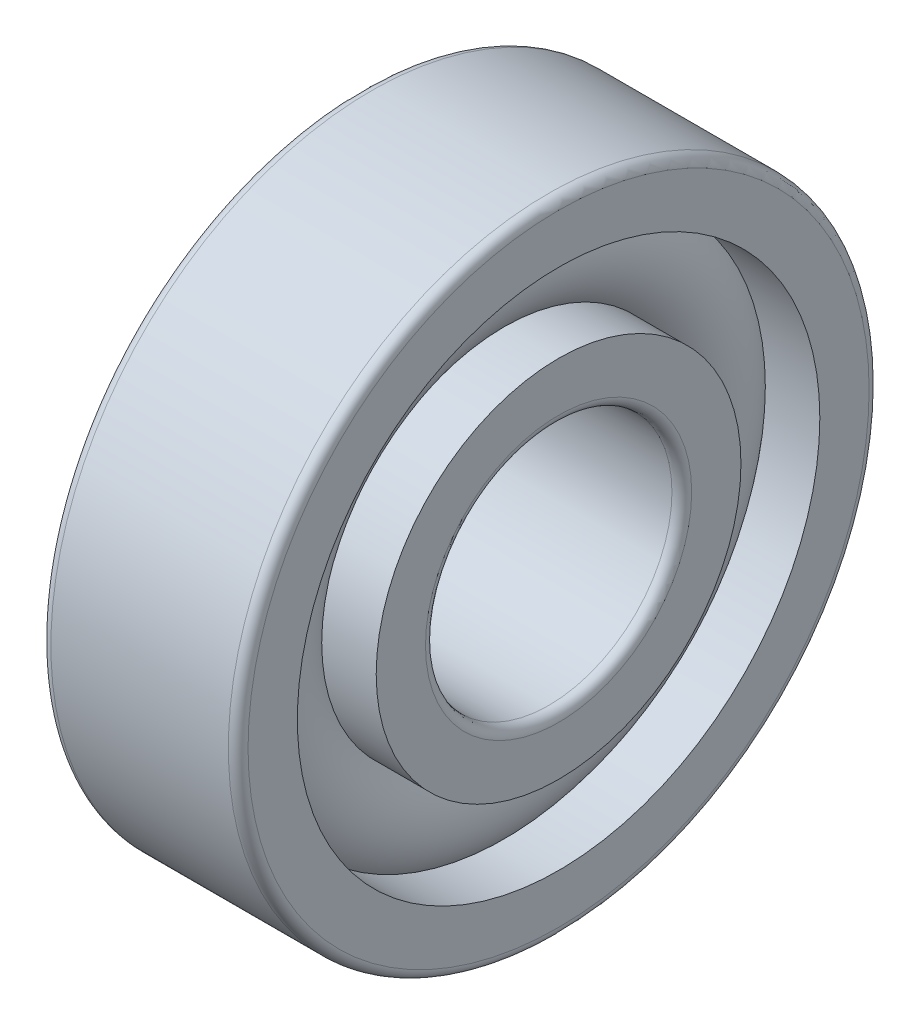
ISO-10303-21;
HEADER;
FILE_DESCRIPTION(('STEP AP214'),'2;1');
FILE_NAME('part.step','',(''),(''),'','','');
FILE_SCHEMA(('AUTOMOTIVE_DESIGN { 1 0 10303 214 1 1 1 1 }'));
ENDSEC;
DATA;
#1=APPLICATION_CONTEXT('core data for automotive mechanical design processes');
#2=APPLICATION_PROTOCOL_DEFINITION('international standard','automotive_design',2000,#1);
#3=PRODUCT_CONTEXT('',#1,'mechanical');
#4=PRODUCT('Part','Part','',(#3));
#5=PRODUCT_RELATED_PRODUCT_CATEGORY('part','',(#4));
#6=PRODUCT_DEFINITION_FORMATION('','',#4);
#7=PRODUCT_DEFINITION_CONTEXT('part definition',#1,'design');
#8=PRODUCT_DEFINITION('design','',#6,#7);
#9=PRODUCT_DEFINITION_SHAPE('','',#8);
#10=(LENGTH_UNIT() NAMED_UNIT(*) SI_UNIT(.MILLI.,.METRE.));
#11=(NAMED_UNIT(*) PLANE_ANGLE_UNIT() SI_UNIT($,.RADIAN.));
#12=(NAMED_UNIT(*) SI_UNIT($,.STERADIAN.) SOLID_ANGLE_UNIT());
#13=UNCERTAINTY_MEASURE_WITH_UNIT(LENGTH_MEASURE(1.E-05),#10,'distance_accuracy_value','');
#14=(GEOMETRIC_REPRESENTATION_CONTEXT(3) GLOBAL_UNCERTAINTY_ASSIGNED_CONTEXT((#13)) GLOBAL_UNIT_ASSIGNED_CONTEXT((#10,
#11,#12)) REPRESENTATION_CONTEXT('',''));
#15=CARTESIAN_POINT('',(0.,0.,0.));
#16=DIRECTION('',(0.,0.,1.));
#17=DIRECTION('',(1.,0.,0.));
#18=AXIS2_PLACEMENT_3D('',#15,#16,#17);
#19=CARTESIAN_POINT('',(0.,0.,0.));
#20=DIRECTION('',(-1.,0.,0.));
#21=DIRECTION('',(0.,0.,1.));
#22=AXIS2_PLACEMENT_3D('',#19,#20,#21);
#23=TOROIDAL_SURFACE('',#22,4.5,1.2);
#24=CARTESIAN_POINT('',(0.89442719099991,0.,0.));
#25=DIRECTION('',(-1.,0.,0.));
#26=DIRECTION('',(0.,0.,1.));
#27=AXIS2_PLACEMENT_3D('',#24,#25,#26);
#28=CIRCLE('',#27,5.30000000000001);
#29=CARTESIAN_POINT('',(0.89442719099991,0.,5.30000000000001));
#30=VERTEX_POINT('',#29);
#31=EDGE_CURVE('E35',#30,#30,#28,.F.);
#32=ORIENTED_EDGE('',*,*,#31,.T.);
#33=EDGE_LOOP('',(#32));
#34=FACE_BOUND('',#33,.T.);
#35=CARTESIAN_POINT('',(0.894427190999915,0.,0.));
#36=DIRECTION('',(-1.,0.,0.));
#37=DIRECTION('',(0.,0.,1.));
#38=AXIS2_PLACEMENT_3D('',#35,#36,#37);
#39=CIRCLE('',#38,3.7);
#40=CARTESIAN_POINT('',(0.894427190999915,0.,3.7));
#41=VERTEX_POINT('',#40);
#42=EDGE_CURVE('E10',#41,#41,#39,.T.);
#43=ORIENTED_EDGE('',*,*,#42,.T.);
#44=EDGE_LOOP('',(#43));
#45=FACE_BOUND('',#44,.T.);
#46=ADVANCED_FACE('F31',(#34,#45),#23,.T.);
#47=CARTESIAN_POINT('',(-20.6375,0.,0.));
#48=DIRECTION('',(1.,0.,0.));
#49=DIRECTION('',(0.,0.,-1.));
#50=AXIS2_PLACEMENT_3D('',#47,#48,#49);
#51=CYLINDRICAL_SURFACE('',#50,3.7);
#52=CARTESIAN_POINT('',(2.,0.,0.));
#53=DIRECTION('',(1.,0.,0.));
#54=DIRECTION('',(0.,0.,-1.));
#55=AXIS2_PLACEMENT_3D('',#52,#53,#54);
#56=CIRCLE('',#55,3.7);
#57=CARTESIAN_POINT('',(2.,0.,-3.7));
#58=VERTEX_POINT('',#57);
#59=EDGE_CURVE('E44',#58,#58,#56,.T.);
#60=ORIENTED_EDGE('',*,*,#59,.F.);
#61=EDGE_LOOP('',(#60));
#62=FACE_BOUND('',#61,.T.);
#63=ORIENTED_EDGE('',*,*,#42,.F.);
#64=EDGE_LOOP('',(#63));
#65=FACE_BOUND('',#64,.T.);
#66=ADVANCED_FACE('F83',(#62,#65),#51,.T.);
#67=CARTESIAN_POINT('',(-20.6375,0.,0.));
#68=DIRECTION('',(1.,0.,0.));
#69=DIRECTION('',(0.,0.,-1.));
#70=AXIS2_PLACEMENT_3D('',#67,#68,#69);
#71=CYLINDRICAL_SURFACE('',#70,3.7);
#72=CARTESIAN_POINT('',(-2.,0.,0.));
#73=DIRECTION('',(1.,0.,0.));
#74=DIRECTION('',(0.,0.,-1.));
#75=AXIS2_PLACEMENT_3D('',#72,#73,#74);
#76=CIRCLE('',#75,3.7);
#77=CARTESIAN_POINT('',(-2.,0.,-3.7));
#78=VERTEX_POINT('',#77);
#79=EDGE_CURVE('E53',#78,#78,#76,.T.);
#80=ORIENTED_EDGE('',*,*,#79,.T.);
#81=EDGE_LOOP('',(#80));
#82=FACE_BOUND('',#81,.T.);
#83=CARTESIAN_POINT('',(-0.894427190999915,0.,0.));
#84=DIRECTION('',(1.,0.,0.));
#85=DIRECTION('',(0.,0.,-1.));
#86=AXIS2_PLACEMENT_3D('',#83,#84,#85);
#87=CIRCLE('',#86,3.7);
#88=CARTESIAN_POINT('',(-0.894427190999915,0.,-3.7));
#89=VERTEX_POINT('',#88);
#90=EDGE_CURVE('E39',#89,#89,#87,.T.);
#91=ORIENTED_EDGE('',*,*,#90,.F.);
#92=EDGE_LOOP('',(#91));
#93=FACE_BOUND('',#92,.T.);
#94=ADVANCED_FACE('F86',(#82,#93),#71,.T.);
#95=CARTESIAN_POINT('',(2.,2.7,0.));
#96=DIRECTION('',(1.,0.,0.));
#97=DIRECTION('',(0.,0.,-1.));
#98=AXIS2_PLACEMENT_3D('',#95,#96,#97);
#99=PLANE('',#98);
#100=ORIENTED_EDGE('',*,*,#59,.T.);
#101=EDGE_LOOP('',(#100));
#102=FACE_BOUND('',#101,.T.);
#103=CARTESIAN_POINT('',(2.,0.,0.));
#104=DIRECTION('',(1.,0.,0.));
#105=DIRECTION('',(0.,0.,-1.));
#106=AXIS2_PLACEMENT_3D('',#103,#104,#105);
#107=CIRCLE('',#106,2.7);
#108=CARTESIAN_POINT('',(2.,0.,-2.7));
#109=VERTEX_POINT('',#108);
#110=EDGE_CURVE('E75',#109,#109,#107,.T.);
#111=ORIENTED_EDGE('',*,*,#110,.F.);
#112=EDGE_LOOP('',(#111));
#113=FACE_BOUND('',#112,.T.);
#114=ADVANCED_FACE('F80',(#102,#113),#99,.T.);
#115=CARTESIAN_POINT('',(1.8,0.,0.));
#116=DIRECTION('',(1.,0.,0.));
#117=DIRECTION('',(0.,0.,-1.));
#118=AXIS2_PLACEMENT_3D('',#115,#116,#117);
#119=TOROIDAL_SURFACE('',#118,2.7,0.2);
#120=ORIENTED_EDGE('',*,*,#110,.T.);
#121=EDGE_LOOP('',(#120));
#122=FACE_BOUND('',#121,.T.);
#123=CARTESIAN_POINT('',(1.8,0.,0.));
#124=DIRECTION('',(1.,0.,0.));
#125=DIRECTION('',(0.,0.,-1.));
#126=AXIS2_PLACEMENT_3D('',#123,#124,#125);
#127=CIRCLE('',#126,2.5);
#128=CARTESIAN_POINT('',(1.8,0.,-2.5));
#129=VERTEX_POINT('',#128);
#130=EDGE_CURVE('E72',#129,#129,#127,.T.);
#131=ORIENTED_EDGE('',*,*,#130,.F.);
#132=EDGE_LOOP('',(#131));
#133=FACE_BOUND('',#132,.T.);
#134=ADVANCED_FACE('F97',(#122,#133),#119,.T.);
#135=CARTESIAN_POINT('',(-20.6375,0.,0.));
#136=DIRECTION('',(1.,0.,0.));
#137=DIRECTION('',(0.,0.,-1.));
#138=AXIS2_PLACEMENT_3D('',#135,#136,#137);
#139=CYLINDRICAL_SURFACE('',#138,2.5);
#140=ORIENTED_EDGE('',*,*,#130,.T.);
#141=EDGE_LOOP('',(#140));
#142=FACE_BOUND('',#141,.T.);
#143=CARTESIAN_POINT('',(-1.8,0.,0.));
#144=DIRECTION('',(1.,0.,0.));
#145=DIRECTION('',(0.,0.,-1.));
#146=AXIS2_PLACEMENT_3D('',#143,#144,#145);
#147=CIRCLE('',#146,2.5);
#148=CARTESIAN_POINT('',(-1.8,0.,-2.5));
#149=VERTEX_POINT('',#148);
#150=EDGE_CURVE('E69',#149,#149,#147,.T.);
#151=ORIENTED_EDGE('',*,*,#150,.F.);
#152=EDGE_LOOP('',(#151));
#153=FACE_BOUND('',#152,.T.);
#154=ADVANCED_FACE('F100',(#142,#153),#139,.F.);
#155=CARTESIAN_POINT('',(-1.8,0.,0.));
#156=DIRECTION('',(1.,0.,0.));
#157=DIRECTION('',(0.,0.,-1.));
#158=AXIS2_PLACEMENT_3D('',#155,#156,#157);
#159=TOROIDAL_SURFACE('',#158,2.7,0.2);
#160=ORIENTED_EDGE('',*,*,#150,.T.);
#161=EDGE_LOOP('',(#160));
#162=FACE_BOUND('',#161,.T.);
#163=CARTESIAN_POINT('',(-2.,0.,0.));
#164=DIRECTION('',(1.,0.,0.));
#165=DIRECTION('',(0.,0.,-1.));
#166=AXIS2_PLACEMENT_3D('',#163,#164,#165);
#167=CIRCLE('',#166,2.7);
#168=CARTESIAN_POINT('',(-2.,0.,-2.7));
#169=VERTEX_POINT('',#168);
#170=EDGE_CURVE('E66',#169,#169,#167,.T.);
#171=ORIENTED_EDGE('',*,*,#170,.F.);
#172=EDGE_LOOP('',(#171));
#173=FACE_BOUND('',#172,.T.);
#174=ADVANCED_FACE('F104',(#162,#173),#159,.T.);
#175=CARTESIAN_POINT('',(-2.,3.7,0.));
#176=DIRECTION('',(-1.,0.,0.));
#177=DIRECTION('',(0.,0.,1.));
#178=AXIS2_PLACEMENT_3D('',#175,#176,#177);
#179=PLANE('',#178);
#180=ORIENTED_EDGE('',*,*,#170,.T.);
#181=EDGE_LOOP('',(#180));
#182=FACE_BOUND('',#181,.T.);
#183=ORIENTED_EDGE('',*,*,#79,.F.);
#184=EDGE_LOOP('',(#183));
#185=FACE_BOUND('',#184,.T.);
#186=ADVANCED_FACE('F108',(#182,#185),#179,.T.);
#187=CARTESIAN_POINT('',(-0.89442719099991,0.,0.));
#188=DIRECTION('',(1.,0.,0.));
#189=DIRECTION('',(0.,0.,-1.));
#190=AXIS2_PLACEMENT_3D('',#187,#188,#189);
#191=CIRCLE('',#190,5.30000000000001);
#192=CARTESIAN_POINT('',(-0.89442719099991,0.,-5.30000000000001));
#193=VERTEX_POINT('',#192);
#194=EDGE_CURVE('E47',#193,#193,#191,.F.);
#195=ORIENTED_EDGE('',*,*,#194,.T.);
#196=EDGE_LOOP('',(#195));
#197=FACE_BOUND('',#196,.T.);
#198=ORIENTED_EDGE('',*,*,#90,.T.);
#199=EDGE_LOOP('',(#198));
#200=FACE_BOUND('',#199,.T.);
#201=ADVANCED_FACE('F33',(#197,#200),#23,.T.);
#202=CARTESIAN_POINT('',(-20.6375,0.,0.));
#203=DIRECTION('',(1.,0.,0.));
#204=DIRECTION('',(0.,0.,-1.));
#205=AXIS2_PLACEMENT_3D('',#202,#203,#204);
#206=CYLINDRICAL_SURFACE('',#205,5.30000000000001);
#207=CARTESIAN_POINT('',(2.,0.,0.));
#208=DIRECTION('',(1.,0.,0.));
#209=DIRECTION('',(0.,0.,-1.));
#210=AXIS2_PLACEMENT_3D('',#207,#208,#209);
#211=CIRCLE('',#210,5.30000000000001);
#212=CARTESIAN_POINT('',(2.,0.,-5.30000000000001));
#213=VERTEX_POINT('',#212);
#214=EDGE_CURVE('E49',#213,#213,#211,.T.);
#215=ORIENTED_EDGE('',*,*,#214,.T.);
#216=EDGE_LOOP('',(#215));
#217=FACE_BOUND('',#216,.T.);
#218=ORIENTED_EDGE('',*,*,#31,.F.);
#219=EDGE_LOOP('',(#218));
#220=FACE_BOUND('',#219,.T.);
#221=ADVANCED_FACE('F113',(#217,#220),#206,.F.);
#222=CARTESIAN_POINT('',(-20.6375,0.,0.));
#223=DIRECTION('',(1.,0.,0.));
#224=DIRECTION('',(0.,0.,-1.));
#225=AXIS2_PLACEMENT_3D('',#222,#223,#224);
#226=CYLINDRICAL_SURFACE('',#225,5.30000000000001);
#227=CARTESIAN_POINT('',(-2.,0.,0.));
#228=DIRECTION('',(1.,0.,0.));
#229=DIRECTION('',(0.,0.,-1.));
#230=AXIS2_PLACEMENT_3D('',#227,#228,#229);
#231=CIRCLE('',#230,5.30000000000001);
#232=CARTESIAN_POINT('',(-2.,0.,-5.30000000000001));
#233=VERTEX_POINT('',#232);
#234=EDGE_CURVE('E144',#233,#233,#231,.T.);
#235=ORIENTED_EDGE('',*,*,#234,.F.);
#236=EDGE_LOOP('',(#235));
#237=FACE_BOUND('',#236,.T.);
#238=ORIENTED_EDGE('',*,*,#194,.F.);
#239=EDGE_LOOP('',(#238));
#240=FACE_BOUND('',#239,.T.);
#241=ADVANCED_FACE('F116',(#237,#240),#226,.F.);
#242=CARTESIAN_POINT('',(2.,6.30000000000001,0.));
#243=DIRECTION('',(1.,0.,0.));
#244=DIRECTION('',(0.,0.,-1.));
#245=AXIS2_PLACEMENT_3D('',#242,#243,#244);
#246=PLANE('',#245);
#247=CARTESIAN_POINT('',(2.,0.,0.));
#248=DIRECTION('',(1.,0.,0.));
#249=DIRECTION('',(0.,0.,-1.));
#250=AXIS2_PLACEMENT_3D('',#247,#248,#249);
#251=CIRCLE('',#250,6.30000000000001);
#252=CARTESIAN_POINT('',(2.,0.,-6.30000000000001));
#253=VERTEX_POINT('',#252);
#254=EDGE_CURVE('E55',#253,#253,#251,.T.);
#255=ORIENTED_EDGE('',*,*,#254,.T.);
#256=EDGE_LOOP('',(#255));
#257=FACE_BOUND('',#256,.T.);
#258=ORIENTED_EDGE('',*,*,#214,.F.);
#259=EDGE_LOOP('',(#258));
#260=FACE_BOUND('',#259,.T.);
#261=ADVANCED_FACE('F117',(#257,#260),#246,.T.);
#262=CARTESIAN_POINT('',(1.8,0.,0.));
#263=DIRECTION('',(1.,0.,0.));
#264=DIRECTION('',(0.,0.,-1.));
#265=AXIS2_PLACEMENT_3D('',#262,#263,#264);
#266=TOROIDAL_SURFACE('',#265,6.30000000000001,0.2);
#267=CARTESIAN_POINT('',(1.8,0.,0.));
#268=DIRECTION('',(1.,0.,0.));
#269=DIRECTION('',(0.,0.,-1.));
#270=AXIS2_PLACEMENT_3D('',#267,#268,#269);
#271=CIRCLE('',#270,6.50000000000001);
#272=CARTESIAN_POINT('',(1.8,0.,-6.50000000000001));
#273=VERTEX_POINT('',#272);
#274=EDGE_CURVE('E60',#273,#273,#271,.T.);
#275=ORIENTED_EDGE('',*,*,#274,.T.);
#276=EDGE_LOOP('',(#275));
#277=FACE_BOUND('',#276,.T.);
#278=ORIENTED_EDGE('',*,*,#254,.F.);
#279=EDGE_LOOP('',(#278));
#280=FACE_BOUND('',#279,.T.);
#281=ADVANCED_FACE('F120',(#277,#280),#266,.T.);
#282=CARTESIAN_POINT('',(-20.6375,0.,0.));
#283=DIRECTION('',(1.,0.,0.));
#284=DIRECTION('',(0.,0.,-1.));
#285=AXIS2_PLACEMENT_3D('',#282,#283,#284);
#286=CYLINDRICAL_SURFACE('',#285,6.50000000000001);
#287=CARTESIAN_POINT('',(-1.8,0.,0.));
#288=DIRECTION('',(1.,0.,0.));
#289=DIRECTION('',(0.,0.,-1.));
#290=AXIS2_PLACEMENT_3D('',#287,#288,#289);
#291=CIRCLE('',#290,6.50000000000001);
#292=CARTESIAN_POINT('',(-1.8,0.,-6.50000000000001));
#293=VERTEX_POINT('',#292);
#294=EDGE_CURVE('E148',#293,#293,#291,.T.);
#295=ORIENTED_EDGE('',*,*,#294,.T.);
#296=EDGE_LOOP('',(#295));
#297=FACE_BOUND('',#296,.T.);
#298=ORIENTED_EDGE('',*,*,#274,.F.);
#299=EDGE_LOOP('',(#298));
#300=FACE_BOUND('',#299,.T.);
#301=ADVANCED_FACE('F124',(#297,#300),#286,.T.);
#302=CARTESIAN_POINT('',(-1.8,0.,0.));
#303=DIRECTION('',(1.,0.,0.));
#304=DIRECTION('',(0.,0.,-1.));
#305=AXIS2_PLACEMENT_3D('',#302,#303,#304);
#306=TOROIDAL_SURFACE('',#305,6.30000000000001,0.2);
#307=CARTESIAN_POINT('',(-2.,0.,0.));
#308=DIRECTION('',(1.,0.,0.));
#309=DIRECTION('',(0.,0.,-1.));
#310=AXIS2_PLACEMENT_3D('',#307,#308,#309);
#311=CIRCLE('',#310,6.30000000000001);
#312=CARTESIAN_POINT('',(-2.,0.,-6.30000000000001));
#313=VERTEX_POINT('',#312);
#314=EDGE_CURVE('E145',#313,#313,#311,.T.);
#315=ORIENTED_EDGE('',*,*,#314,.T.);
#316=EDGE_LOOP('',(#315));
#317=FACE_BOUND('',#316,.T.);
#318=ORIENTED_EDGE('',*,*,#294,.F.);
#319=EDGE_LOOP('',(#318));
#320=FACE_BOUND('',#319,.T.);
#321=ADVANCED_FACE('F128',(#317,#320),#306,.T.);
#322=CARTESIAN_POINT('',(-2.,5.30000000000001,0.));
#323=DIRECTION('',(-1.,0.,0.));
#324=DIRECTION('',(0.,0.,1.));
#325=AXIS2_PLACEMENT_3D('',#322,#323,#324);
#326=PLANE('',#325);
#327=ORIENTED_EDGE('',*,*,#234,.T.);
#328=EDGE_LOOP('',(#327));
#329=FACE_BOUND('',#328,.T.);
#330=ORIENTED_EDGE('',*,*,#314,.F.);
#331=EDGE_LOOP('',(#330));
#332=FACE_BOUND('',#331,.T.);
#333=ADVANCED_FACE('F132',(#329,#332),#326,.T.);
#334=CLOSED_SHELL('',(#46,#66,#94,#114,#134,#154,#174,#186,#201,#221,#241,#261,#281,#301,#321,#333));
#335=MANIFOLD_SOLID_BREP('B2',#334);
#336=ADVANCED_BREP_SHAPE_REPRESENTATION('',(#18,#335),#14);
#337=SHAPE_DEFINITION_REPRESENTATION(#9,#336);
ENDSEC;
END-ISO-10303-21;
